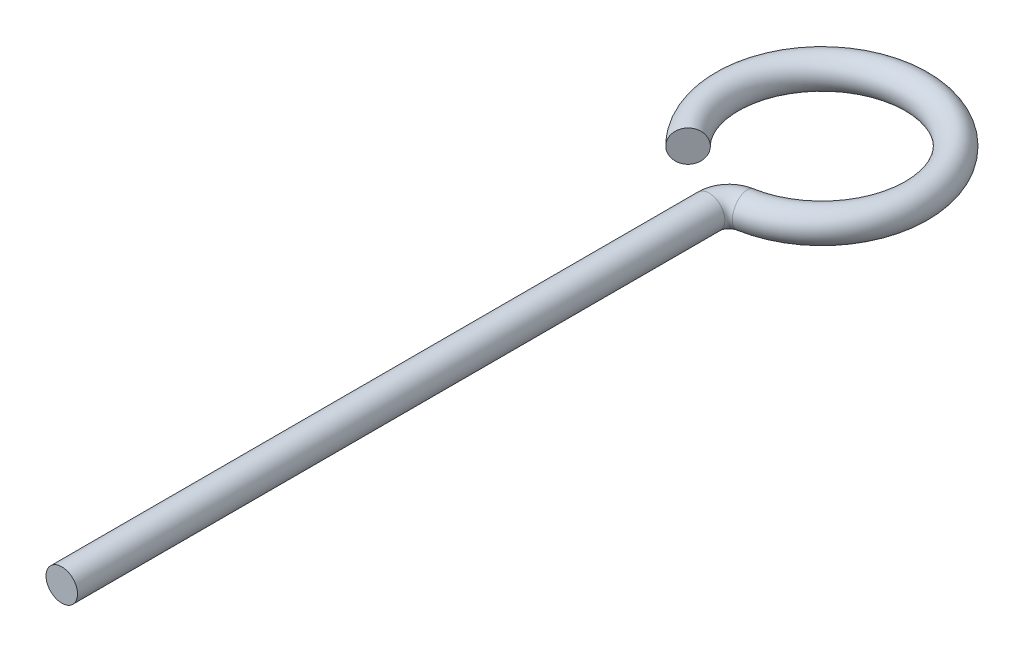
ISO-10303-21;
HEADER;
FILE_DESCRIPTION(('STEP AP214'),'2;1');
FILE_NAME('part.step','',(''),(''),'','','');
FILE_SCHEMA(('AUTOMOTIVE_DESIGN { 1 0 10303 214 1 1 1 1 }'));
ENDSEC;
DATA;
#1=APPLICATION_CONTEXT('core data for automotive mechanical design processes');
#2=APPLICATION_PROTOCOL_DEFINITION('international standard','automotive_design',2000,#1);
#3=PRODUCT_CONTEXT('',#1,'mechanical');
#4=PRODUCT('Part','Part','',(#3));
#5=PRODUCT_RELATED_PRODUCT_CATEGORY('part','',(#4));
#6=PRODUCT_DEFINITION_FORMATION('','',#4);
#7=PRODUCT_DEFINITION_CONTEXT('part definition',#1,'design');
#8=PRODUCT_DEFINITION('design','',#6,#7);
#9=PRODUCT_DEFINITION_SHAPE('','',#8);
#10=(LENGTH_UNIT() NAMED_UNIT(*) SI_UNIT(.MILLI.,.METRE.));
#11=(NAMED_UNIT(*) PLANE_ANGLE_UNIT() SI_UNIT($,.RADIAN.));
#12=(NAMED_UNIT(*) SI_UNIT($,.STERADIAN.) SOLID_ANGLE_UNIT());
#13=UNCERTAINTY_MEASURE_WITH_UNIT(LENGTH_MEASURE(1.E-05),#10,'distance_accuracy_value','');
#14=(GEOMETRIC_REPRESENTATION_CONTEXT(3) GLOBAL_UNCERTAINTY_ASSIGNED_CONTEXT((#13)) GLOBAL_UNIT_ASSIGNED_CONTEXT((#10,
#11,#12)) REPRESENTATION_CONTEXT('',''));
#15=CARTESIAN_POINT('',(0.,0.,0.));
#16=DIRECTION('',(0.,0.,1.));
#17=DIRECTION('',(1.,0.,0.));
#18=AXIS2_PLACEMENT_3D('',#15,#16,#17);
#19=CARTESIAN_POINT('',(0.,0.,0.));
#20=DIRECTION('',(0.,0.,1.));
#21=DIRECTION('',(1.,0.,0.));
#22=AXIS2_PLACEMENT_3D('',#19,#20,#21);
#23=PLANE('',#22);
#24=CARTESIAN_POINT('',(0.,0.,0.));
#25=DIRECTION('',(0.,0.,1.));
#26=DIRECTION('',(1.,0.,0.));
#27=AXIS2_PLACEMENT_3D('',#24,#25,#26);
#28=CIRCLE('',#27,1.585);
#29=CARTESIAN_POINT('',(1.585,0.,0.));
#30=VERTEX_POINT('',#29);
#31=EDGE_CURVE('E45',#30,#30,#28,.T.);
#32=ORIENTED_EDGE('',*,*,#31,.T.);
#33=EDGE_LOOP('',(#32));
#34=FACE_BOUND('',#33,.T.);
#35=ADVANCED_FACE('F33',(#34),#23,.T.);
#36=CARTESIAN_POINT('',(-6.72458548908399,0.,-69.6654145109159));
#37=DIRECTION('',(-0.707106781186556,0.,-0.707106781186539));
#38=DIRECTION('',(-0.707106781186539,0.,0.707106781186556));
#39=AXIS2_PLACEMENT_3D('',#36,#37,#38);
#40=PLANE('',#39);
#41=CARTESIAN_POINT('',(-6.72458548908399,0.,-69.6654145109159));
#42=DIRECTION('',(-0.707106781186556,0.,-0.707106781186539));
#43=DIRECTION('',(-0.707106781186539,0.,0.707106781186556));
#44=AXIS2_PLACEMENT_3D('',#41,#42,#43);
#45=CIRCLE('',#44,1.585);
#46=CARTESIAN_POINT('',(-7.84534973726465,0.,-68.5446502627351));
#47=VERTEX_POINT('',#46);
#48=EDGE_CURVE('E11',#47,#47,#45,.T.);
#49=ORIENTED_EDGE('',*,*,#48,.F.);
#50=EDGE_LOOP('',(#49));
#51=FACE_BOUND('',#50,.T.);
#52=ADVANCED_FACE('F51',(#51),#40,.F.);
#53=CARTESIAN_POINT('',(0.,0.,0.));
#54=DIRECTION('',(0.,0.,-1.));
#55=DIRECTION('',(-1.,0.,0.));
#56=AXIS2_PLACEMENT_3D('',#53,#54,#55);
#57=CYLINDRICAL_SURFACE('',#56,1.585);
#58=CARTESIAN_POINT('',(0.,0.,-65.0550937366028));
#59=DIRECTION('',(0.,0.,1.));
#60=DIRECTION('',(1.,0.,0.));
#61=AXIS2_PLACEMENT_3D('',#58,#59,#60);
#62=CIRCLE('',#61,1.585);
#63=CARTESIAN_POINT('',(-1.585,0.,-65.0550937366028));
#64=VERTEX_POINT('',#63);
#65=EDGE_CURVE('E76',#64,#64,#62,.T.);
#66=ORIENTED_EDGE('',*,*,#65,.T.);
#67=EDGE_LOOP('',(#66));
#68=FACE_BOUND('',#67,.T.);
#69=ORIENTED_EDGE('',*,*,#31,.F.);
#70=EDGE_LOOP('',(#69));
#71=FACE_BOUND('',#70,.T.);
#72=ADVANCED_FACE('F53',(#68,#71),#57,.T.);
#73=CARTESIAN_POINT('',(2.,0.,-65.0550937366028));
#74=DIRECTION('',(0.,-1.,0.));
#75=DIRECTION('',(0.,0.,-1.));
#76=AXIS2_PLACEMENT_3D('',#73,#74,#75);
#77=TOROIDAL_SURFACE('',#76,2.,1.585);
#78=CARTESIAN_POINT('',(1.65247610773241,0.,-67.0246691081749));
#79=DIRECTION('',(-0.984787685786025,0.,0.173761946133797));
#80=DIRECTION('',(0.173761946133797,0.,0.984787685786025));
#81=AXIS2_PLACEMENT_3D('',#78,#79,#80);
#82=CIRCLE('',#81,1.585);
#83=CARTESIAN_POINT('',(1.37706342311034,0.,-68.5855575901457));
#84=VERTEX_POINT('',#83);
#85=EDGE_CURVE('E40',#84,#84,#82,.T.);
#86=CARTESIAN_POINT('',(2.,0.,-65.0550937366028));
#87=DIRECTION('',(0.,-1.,0.));
#88=DIRECTION('',(0.,0.,-1.));
#89=AXIS2_PLACEMENT_3D('',#86,#87,#88);
#90=CIRCLE('',#89,3.585);
#91=EDGE_CURVE('',#64,#84,#90,.T.);
#92=ORIENTED_EDGE('',*,*,#65,.F.);
#93=ORIENTED_EDGE('',*,*,#85,.T.);
#94=ORIENTED_EDGE('',*,*,#91,.T.);
#95=ORIENTED_EDGE('',*,*,#91,.F.);
#96=EDGE_LOOP('',(#92,#94,#93,#95));
#97=FACE_BOUND('',#96,.T.);
#98=ADVANCED_FACE('F58',(#97),#77,.T.);
#99=CARTESIAN_POINT('',(0.,0.,-76.39));
#100=DIRECTION('',(0.,1.,0.));
#101=DIRECTION('',(0.,0.,1.));
#102=AXIS2_PLACEMENT_3D('',#99,#100,#101);
#103=TOROIDAL_SURFACE('',#102,9.51,1.585);
#104=ORIENTED_EDGE('',*,*,#48,.T.);
#105=EDGE_LOOP('',(#104));
#106=FACE_BOUND('',#105,.T.);
#107=ORIENTED_EDGE('',*,*,#85,.F.);
#108=EDGE_LOOP('',(#107));
#109=FACE_BOUND('',#108,.T.);
#110=ADVANCED_FACE('F48',(#106,#109),#103,.T.);
#111=CLOSED_SHELL('',(#35,#52,#72,#98,#110));
#112=MANIFOLD_SOLID_BREP('B2',#111);
#113=ADVANCED_BREP_SHAPE_REPRESENTATION('',(#18,#112),#14);
#114=SHAPE_DEFINITION_REPRESENTATION(#9,#113);
ENDSEC;
END-ISO-10303-21;
